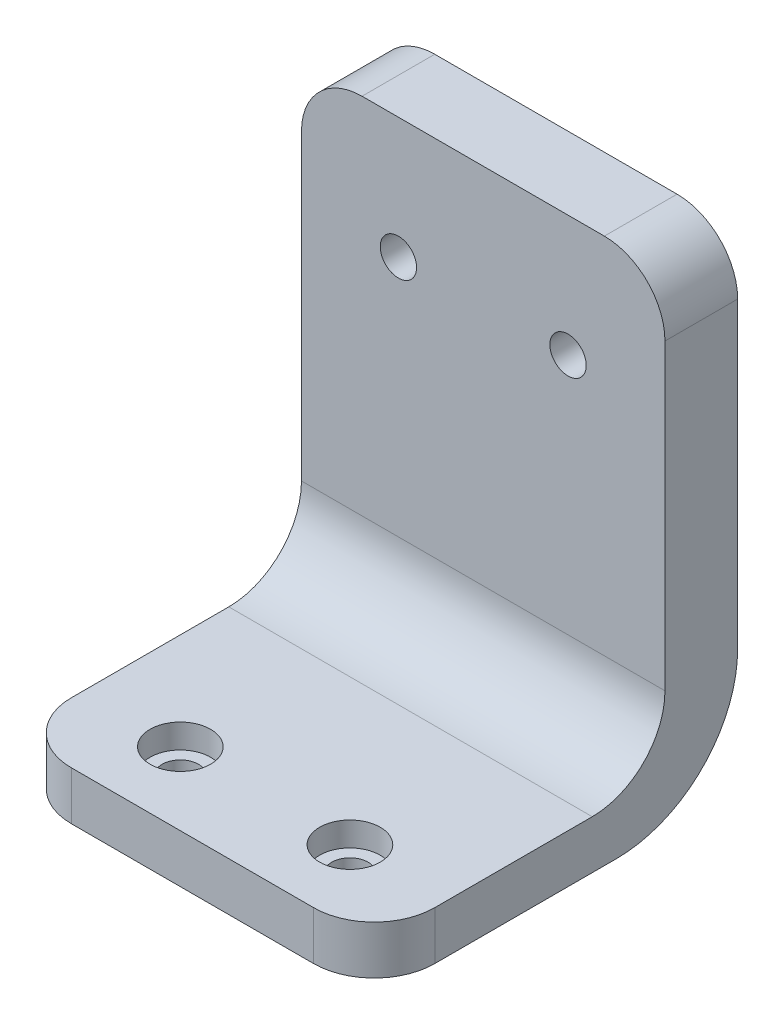
ISO-10303-21;
HEADER;
FILE_DESCRIPTION(('STEP AP214'),'2;1');
FILE_NAME('part.step','',(''),(''),'','','');
FILE_SCHEMA(('AUTOMOTIVE_DESIGN { 1 0 10303 214 1 1 1 1 }'));
ENDSEC;
DATA;
#1=APPLICATION_CONTEXT('core data for automotive mechanical design processes');
#2=APPLICATION_PROTOCOL_DEFINITION('international standard','automotive_design',2000,#1);
#3=PRODUCT_CONTEXT('',#1,'mechanical');
#4=PRODUCT('Part','Part','',(#3));
#5=PRODUCT_RELATED_PRODUCT_CATEGORY('part','',(#4));
#6=PRODUCT_DEFINITION_FORMATION('','',#4);
#7=PRODUCT_DEFINITION_CONTEXT('part definition',#1,'design');
#8=PRODUCT_DEFINITION('design','',#6,#7);
#9=PRODUCT_DEFINITION_SHAPE('','',#8);
#10=(LENGTH_UNIT() NAMED_UNIT(*) SI_UNIT(.MILLI.,.METRE.));
#11=(NAMED_UNIT(*) PLANE_ANGLE_UNIT() SI_UNIT($,.RADIAN.));
#12=(NAMED_UNIT(*) SI_UNIT($,.STERADIAN.) SOLID_ANGLE_UNIT());
#13=UNCERTAINTY_MEASURE_WITH_UNIT(LENGTH_MEASURE(1.E-05),#10,'distance_accuracy_value','');
#14=(GEOMETRIC_REPRESENTATION_CONTEXT(3) GLOBAL_UNCERTAINTY_ASSIGNED_CONTEXT((#13)) GLOBAL_UNIT_ASSIGNED_CONTEXT((#10,
#11,#12)) REPRESENTATION_CONTEXT('',''));
#15=CARTESIAN_POINT('',(0.,0.,0.));
#16=DIRECTION('',(0.,0.,1.));
#17=DIRECTION('',(1.,0.,0.));
#18=AXIS2_PLACEMENT_3D('',#15,#16,#17);
#19=CARTESIAN_POINT('',(22.,-25.001,18.));
#20=DIRECTION('',(0.,1.,0.));
#21=DIRECTION('',(0.,0.,1.));
#22=AXIS2_PLACEMENT_3D('',#19,#20,#21);
#23=CYLINDRICAL_SURFACE('',#22,1.5);
#24=CARTESIAN_POINT('',(22.,-25.,18.));
#25=DIRECTION('',(0.,1.,0.));
#26=DIRECTION('',(0.,0.,1.));
#27=AXIS2_PLACEMENT_3D('',#24,#25,#26);
#28=CIRCLE('',#27,1.5);
#29=CARTESIAN_POINT('',(22.,-25.,19.5));
#30=VERTEX_POINT('',#29);
#31=EDGE_CURVE('E226',#30,#30,#28,.F.);
#32=ORIENTED_EDGE('',*,*,#31,.T.);
#33=EDGE_LOOP('',(#32));
#34=FACE_BOUND('',#33,.T.);
#35=CARTESIAN_POINT('',(22.,-23.,18.));
#36=DIRECTION('',(0.,1.,0.));
#37=DIRECTION('',(0.,0.,1.));
#38=AXIS2_PLACEMENT_3D('',#35,#36,#37);
#39=CIRCLE('',#38,1.5);
#40=CARTESIAN_POINT('',(22.,-23.,19.5));
#41=VERTEX_POINT('',#40);
#42=EDGE_CURVE('E38',#41,#41,#39,.F.);
#43=ORIENTED_EDGE('',*,*,#42,.F.);
#44=EDGE_LOOP('',(#43));
#45=FACE_BOUND('',#44,.T.);
#46=ADVANCED_FACE('F34',(#34,#45),#23,.F.);
#47=CARTESIAN_POINT('',(8.,-25.001,18.));
#48=DIRECTION('',(0.,1.,0.));
#49=DIRECTION('',(0.,0.,1.));
#50=AXIS2_PLACEMENT_3D('',#47,#48,#49);
#51=CYLINDRICAL_SURFACE('',#50,1.5);
#52=CARTESIAN_POINT('',(8.,-25.,18.));
#53=DIRECTION('',(0.,1.,0.));
#54=DIRECTION('',(0.,0.,1.));
#55=AXIS2_PLACEMENT_3D('',#52,#53,#54);
#56=CIRCLE('',#55,1.5);
#57=CARTESIAN_POINT('',(8.,-25.,19.5));
#58=VERTEX_POINT('',#57);
#59=EDGE_CURVE('E165',#58,#58,#56,.F.);
#60=ORIENTED_EDGE('',*,*,#59,.T.);
#61=EDGE_LOOP('',(#60));
#62=FACE_BOUND('',#61,.T.);
#63=CARTESIAN_POINT('',(8.,-23.,18.));
#64=DIRECTION('',(0.,1.,0.));
#65=DIRECTION('',(0.,0.,1.));
#66=AXIS2_PLACEMENT_3D('',#63,#64,#65);
#67=CIRCLE('',#66,1.5);
#68=CARTESIAN_POINT('',(8.,-23.,19.5));
#69=VERTEX_POINT('',#68);
#70=EDGE_CURVE('E220',#69,#69,#67,.F.);
#71=ORIENTED_EDGE('',*,*,#70,.F.);
#72=EDGE_LOOP('',(#71));
#73=FACE_BOUND('',#72,.T.);
#74=ADVANCED_FACE('F301',(#62,#73),#51,.F.);
#75=CARTESIAN_POINT('',(30.,15.,-6.));
#76=DIRECTION('',(0.,-1.,0.));
#77=DIRECTION('',(0.,0.,-1.));
#78=AXIS2_PLACEMENT_3D('',#75,#76,#77);
#79=PLANE('',#78);
#80=DIRECTION('',(-1.,0.,0.));
#81=VECTOR('',#80,1.);
#82=CARTESIAN_POINT('',(30.,15.,0.));
#83=LINE('',#82,#81);
#84=CARTESIAN_POINT('',(25.,15.,0.));
#85=VERTEX_POINT('',#84);
#86=CARTESIAN_POINT('',(5.,15.,0.));
#87=VERTEX_POINT('',#86);
#88=EDGE_CURVE('E145',#85,#87,#83,.T.);
#89=ORIENTED_EDGE('',*,*,#88,.F.);
#90=DIRECTION('',(0.,0.,1.));
#91=VECTOR('',#90,1.);
#92=CARTESIAN_POINT('',(25.,15.,-6.));
#93=LINE('',#92,#91);
#94=CARTESIAN_POINT('',(25.,15.,-6.));
#95=VERTEX_POINT('',#94);
#96=EDGE_CURVE('E202',#85,#95,#93,.F.);
#97=ORIENTED_EDGE('',*,*,#96,.T.);
#98=DIRECTION('',(-1.,0.,0.));
#99=VECTOR('',#98,1.);
#100=CARTESIAN_POINT('',(30.,15.,-6.));
#101=LINE('',#100,#99);
#102=CARTESIAN_POINT('',(5.,15.,-6.));
#103=VERTEX_POINT('',#102);
#104=EDGE_CURVE('E162',#95,#103,#101,.T.);
#105=ORIENTED_EDGE('',*,*,#104,.T.);
#106=DIRECTION('',(0.,0.,1.));
#107=VECTOR('',#106,1.);
#108=CARTESIAN_POINT('',(5.,15.,0.));
#109=LINE('',#108,#107);
#110=EDGE_CURVE('E199',#103,#87,#109,.T.);
#111=ORIENTED_EDGE('',*,*,#110,.T.);
#112=EDGE_LOOP('',(#89,#97,#105,#111));
#113=FACE_BOUND('',#112,.T.);
#114=ADVANCED_FACE('F288',(#113),#79,.F.);
#115=CARTESIAN_POINT('',(30.,15.,0.));
#116=DIRECTION('',(0.,0.,-1.));
#117=DIRECTION('',(0.,1.,0.));
#118=AXIS2_PLACEMENT_3D('',#115,#116,#117);
#119=PLANE('',#118);
#120=CARTESIAN_POINT('',(8.,5.,0.));
#121=DIRECTION('',(0.,0.,1.));
#122=DIRECTION('',(1.,0.,0.));
#123=AXIS2_PLACEMENT_3D('',#120,#121,#122);
#124=CIRCLE('',#123,1.5);
#125=CARTESIAN_POINT('',(9.5,5.,0.));
#126=VERTEX_POINT('',#125);
#127=EDGE_CURVE('E464',#126,#126,#124,.T.);
#128=ORIENTED_EDGE('',*,*,#127,.F.);
#129=EDGE_LOOP('',(#128));
#130=FACE_BOUND('',#129,.T.);
#131=CARTESIAN_POINT('',(22.,5.,0.));
#132=DIRECTION('',(0.,0.,1.));
#133=DIRECTION('',(1.,0.,0.));
#134=AXIS2_PLACEMENT_3D('',#131,#132,#133);
#135=CIRCLE('',#134,1.5);
#136=CARTESIAN_POINT('',(23.5,5.,0.));
#137=VERTEX_POINT('',#136);
#138=EDGE_CURVE('E236',#137,#137,#135,.T.);
#139=ORIENTED_EDGE('',*,*,#138,.F.);
#140=EDGE_LOOP('',(#139));
#141=FACE_BOUND('',#140,.T.);
#142=DIRECTION('',(0.,-1.,0.));
#143=VECTOR('',#142,1.);
#144=CARTESIAN_POINT('',(30.,15.,0.));
#145=LINE('',#144,#143);
#146=CARTESIAN_POINT('',(30.,10.,0.));
#147=VERTEX_POINT('',#146);
#148=CARTESIAN_POINT('',(30.,-15.,0.));
#149=VERTEX_POINT('',#148);
#150=EDGE_CURVE('E125',#147,#149,#145,.T.);
#151=ORIENTED_EDGE('',*,*,#150,.F.);
#152=CARTESIAN_POINT('',(25.,10.,0.));
#153=DIRECTION('',(0.,0.,-1.));
#154=DIRECTION('',(0.,1.,0.));
#155=AXIS2_PLACEMENT_3D('',#152,#153,#154);
#156=CIRCLE('',#155,5.);
#157=EDGE_CURVE('E197',#147,#85,#156,.F.);
#158=ORIENTED_EDGE('',*,*,#157,.T.);
#159=ORIENTED_EDGE('',*,*,#88,.T.);
#160=CARTESIAN_POINT('',(5.,10.,0.));
#161=DIRECTION('',(0.,0.,-1.));
#162=DIRECTION('',(0.,1.,0.));
#163=AXIS2_PLACEMENT_3D('',#160,#161,#162);
#164=CIRCLE('',#163,5.);
#165=CARTESIAN_POINT('',(0.,10.,0.));
#166=VERTEX_POINT('',#165);
#167=EDGE_CURVE('E195',#87,#166,#164,.F.);
#168=ORIENTED_EDGE('',*,*,#167,.T.);
#169=DIRECTION('',(0.,-1.,0.));
#170=VECTOR('',#169,1.);
#171=CARTESIAN_POINT('',(0.,15.,0.));
#172=LINE('',#171,#170);
#173=CARTESIAN_POINT('',(0.,-15.,0.));
#174=VERTEX_POINT('',#173);
#175=EDGE_CURVE('E142',#166,#174,#172,.T.);
#176=ORIENTED_EDGE('',*,*,#175,.T.);
#177=DIRECTION('',(-1.,0.,0.));
#178=VECTOR('',#177,1.);
#179=CARTESIAN_POINT('',(30.,-15.,0.));
#180=LINE('',#179,#178);
#181=EDGE_CURVE('E139',#149,#174,#180,.T.);
#182=ORIENTED_EDGE('',*,*,#181,.F.);
#183=EDGE_LOOP('',(#151,#158,#159,#168,#176,#182));
#184=FACE_BOUND('',#183,.T.);
#185=ADVANCED_FACE('F140',(#130,#141,#184),#119,.F.);
#186=CARTESIAN_POINT('',(30.,-15.,6.));
#187=DIRECTION('',(-1.,0.,0.));
#188=DIRECTION('',(0.,0.,1.));
#189=AXIS2_PLACEMENT_3D('',#186,#187,#188);
#190=CYLINDRICAL_SURFACE('',#189,6.);
#191=CARTESIAN_POINT('',(0.,-15.,6.));
#192=DIRECTION('',(-1.,0.,0.));
#193=DIRECTION('',(0.,0.,1.));
#194=AXIS2_PLACEMENT_3D('',#191,#192,#193);
#195=CIRCLE('',#194,6.);
#196=CARTESIAN_POINT('',(0.,-21.,6.));
#197=VERTEX_POINT('',#196);
#198=EDGE_CURVE('E164',#174,#197,#195,.T.);
#199=ORIENTED_EDGE('',*,*,#198,.T.);
#200=DIRECTION('',(-1.,0.,0.));
#201=VECTOR('',#200,1.);
#202=CARTESIAN_POINT('',(30.,-21.,6.));
#203=LINE('',#202,#201);
#204=CARTESIAN_POINT('',(30.,-21.,6.));
#205=VERTEX_POINT('',#204);
#206=EDGE_CURVE('E146',#205,#197,#203,.T.);
#207=ORIENTED_EDGE('',*,*,#206,.F.);
#208=CARTESIAN_POINT('',(30.,-15.,6.));
#209=DIRECTION('',(-1.,0.,0.));
#210=DIRECTION('',(0.,0.,1.));
#211=AXIS2_PLACEMENT_3D('',#208,#209,#210);
#212=CIRCLE('',#211,6.);
#213=EDGE_CURVE('E131',#149,#205,#212,.T.);
#214=ORIENTED_EDGE('',*,*,#213,.F.);
#215=ORIENTED_EDGE('',*,*,#181,.T.);
#216=EDGE_LOOP('',(#199,#207,#214,#215));
#217=FACE_BOUND('',#216,.T.);
#218=ADVANCED_FACE('F148',(#217),#190,.F.);
#219=CARTESIAN_POINT('',(30.,-21.,6.));
#220=DIRECTION('',(0.,-1.,0.));
#221=DIRECTION('',(0.,0.,-1.));
#222=AXIS2_PLACEMENT_3D('',#219,#220,#221);
#223=PLANE('',#222);
#224=CARTESIAN_POINT('',(8.,-21.,18.));
#225=DIRECTION('',(0.,1.,0.));
#226=DIRECTION('',(0.,0.,1.));
#227=AXIS2_PLACEMENT_3D('',#224,#225,#226);
#228=CIRCLE('',#227,2.5);
#229=CARTESIAN_POINT('',(8.,-21.,20.5));
#230=VERTEX_POINT('',#229);
#231=EDGE_CURVE('E228',#230,#230,#228,.T.);
#232=ORIENTED_EDGE('',*,*,#231,.F.);
#233=EDGE_LOOP('',(#232));
#234=FACE_BOUND('',#233,.T.);
#235=CARTESIAN_POINT('',(22.,-21.,18.));
#236=DIRECTION('',(0.,1.,0.));
#237=DIRECTION('',(0.,0.,1.));
#238=AXIS2_PLACEMENT_3D('',#235,#236,#237);
#239=CIRCLE('',#238,2.5);
#240=CARTESIAN_POINT('',(22.,-21.,20.5));
#241=VERTEX_POINT('',#240);
#242=EDGE_CURVE('E233',#241,#241,#239,.T.);
#243=ORIENTED_EDGE('',*,*,#242,.F.);
#244=EDGE_LOOP('',(#243));
#245=FACE_BOUND('',#244,.T.);
#246=DIRECTION('',(-1.,0.,0.));
#247=VECTOR('',#246,1.);
#248=CARTESIAN_POINT('',(30.,-21.,24.));
#249=LINE('',#248,#247);
#250=CARTESIAN_POINT('',(25.,-21.,24.));
#251=VERTEX_POINT('',#250);
#252=CARTESIAN_POINT('',(5.,-21.,24.));
#253=VERTEX_POINT('',#252);
#254=EDGE_CURVE('E186',#251,#253,#249,.T.);
#255=ORIENTED_EDGE('',*,*,#254,.F.);
#256=CARTESIAN_POINT('',(25.,-21.,19.));
#257=DIRECTION('',(0.,-1.,0.));
#258=DIRECTION('',(0.,0.,-1.));
#259=AXIS2_PLACEMENT_3D('',#256,#257,#258);
#260=CIRCLE('',#259,5.);
#261=CARTESIAN_POINT('',(30.,-21.,19.));
#262=VERTEX_POINT('',#261);
#263=EDGE_CURVE('E11',#251,#262,#260,.F.);
#264=ORIENTED_EDGE('',*,*,#263,.T.);
#265=DIRECTION('',(0.,0.,1.));
#266=VECTOR('',#265,1.);
#267=CARTESIAN_POINT('',(30.,-21.,6.));
#268=LINE('',#267,#266);
#269=EDGE_CURVE('E151',#205,#262,#268,.T.);
#270=ORIENTED_EDGE('',*,*,#269,.F.);
#271=ORIENTED_EDGE('',*,*,#206,.T.);
#272=DIRECTION('',(0.,0.,1.));
#273=VECTOR('',#272,1.);
#274=CARTESIAN_POINT('',(0.,-21.,6.));
#275=LINE('',#274,#273);
#276=CARTESIAN_POINT('',(0.,-21.,19.));
#277=VERTEX_POINT('',#276);
#278=EDGE_CURVE('E167',#197,#277,#275,.T.);
#279=ORIENTED_EDGE('',*,*,#278,.T.);
#280=CARTESIAN_POINT('',(5.,-21.,19.));
#281=DIRECTION('',(0.,-1.,0.));
#282=DIRECTION('',(0.,0.,-1.));
#283=AXIS2_PLACEMENT_3D('',#280,#281,#282);
#284=CIRCLE('',#283,5.);
#285=EDGE_CURVE('E43',#277,#253,#284,.F.);
#286=ORIENTED_EDGE('',*,*,#285,.T.);
#287=EDGE_LOOP('',(#255,#264,#270,#271,#279,#286));
#288=FACE_BOUND('',#287,.T.);
#289=ADVANCED_FACE('F266',(#234,#245,#288),#223,.F.);
#290=CARTESIAN_POINT('',(30.,-21.,24.));
#291=DIRECTION('',(0.,0.,-1.));
#292=DIRECTION('',(-1.,0.,0.));
#293=AXIS2_PLACEMENT_3D('',#290,#291,#292);
#294=PLANE('',#293);
#295=DIRECTION('',(-1.,0.,0.));
#296=VECTOR('',#295,1.);
#297=CARTESIAN_POINT('',(30.,-25.,24.));
#298=LINE('',#297,#296);
#299=CARTESIAN_POINT('',(25.,-25.,24.));
#300=VERTEX_POINT('',#299);
#301=CARTESIAN_POINT('',(5.,-25.,24.));
#302=VERTEX_POINT('',#301);
#303=EDGE_CURVE('E183',#300,#302,#298,.T.);
#304=ORIENTED_EDGE('',*,*,#303,.F.);
#305=DIRECTION('',(0.,-1.,0.));
#306=VECTOR('',#305,1.);
#307=CARTESIAN_POINT('',(25.,-21.,24.));
#308=LINE('',#307,#306);
#309=EDGE_CURVE('E57',#300,#251,#308,.F.);
#310=ORIENTED_EDGE('',*,*,#309,.T.);
#311=ORIENTED_EDGE('',*,*,#254,.T.);
#312=DIRECTION('',(0.,-1.,0.));
#313=VECTOR('',#312,1.);
#314=CARTESIAN_POINT('',(5.,-25.,24.));
#315=LINE('',#314,#313);
#316=EDGE_CURVE('E216',#253,#302,#315,.T.);
#317=ORIENTED_EDGE('',*,*,#316,.T.);
#318=EDGE_LOOP('',(#304,#310,#311,#317));
#319=FACE_BOUND('',#318,.T.);
#320=ADVANCED_FACE('F255',(#319),#294,.F.);
#321=CARTESIAN_POINT('',(30.,-25.,24.));
#322=DIRECTION('',(0.,1.,0.));
#323=DIRECTION('',(0.,0.,1.));
#324=AXIS2_PLACEMENT_3D('',#321,#322,#323);
#325=PLANE('',#324);
#326=ORIENTED_EDGE('',*,*,#59,.F.);
#327=EDGE_LOOP('',(#326));
#328=FACE_BOUND('',#327,.T.);
#329=ORIENTED_EDGE('',*,*,#31,.F.);
#330=EDGE_LOOP('',(#329));
#331=FACE_BOUND('',#330,.T.);
#332=DIRECTION('',(0.,0.,-1.));
#333=VECTOR('',#332,1.);
#334=CARTESIAN_POINT('',(30.,-25.,24.));
#335=LINE('',#334,#333);
#336=CARTESIAN_POINT('',(30.,-25.,19.));
#337=VERTEX_POINT('',#336);
#338=CARTESIAN_POINT('',(30.,-25.,4.00000000000001));
#339=VERTEX_POINT('',#338);
#340=EDGE_CURVE('E153',#337,#339,#335,.T.);
#341=ORIENTED_EDGE('',*,*,#340,.F.);
#342=CARTESIAN_POINT('',(25.,-25.,19.));
#343=DIRECTION('',(0.,1.,0.));
#344=DIRECTION('',(0.,0.,1.));
#345=AXIS2_PLACEMENT_3D('',#342,#343,#344);
#346=CIRCLE('',#345,5.);
#347=EDGE_CURVE('E214',#337,#300,#346,.F.);
#348=ORIENTED_EDGE('',*,*,#347,.T.);
#349=ORIENTED_EDGE('',*,*,#303,.T.);
#350=CARTESIAN_POINT('',(5.,-25.,19.));
#351=DIRECTION('',(0.,1.,0.));
#352=DIRECTION('',(0.,0.,1.));
#353=AXIS2_PLACEMENT_3D('',#350,#351,#352);
#354=CIRCLE('',#353,5.);
#355=CARTESIAN_POINT('',(0.,-25.,19.));
#356=VERTEX_POINT('',#355);
#357=EDGE_CURVE('E212',#302,#356,#354,.F.);
#358=ORIENTED_EDGE('',*,*,#357,.T.);
#359=DIRECTION('',(0.,0.,-1.));
#360=VECTOR('',#359,1.);
#361=CARTESIAN_POINT('',(0.,-25.,24.));
#362=LINE('',#361,#360);
#363=CARTESIAN_POINT('',(0.,-25.,4.00000000000001));
#364=VERTEX_POINT('',#363);
#365=EDGE_CURVE('E169',#356,#364,#362,.T.);
#366=ORIENTED_EDGE('',*,*,#365,.T.);
#367=DIRECTION('',(-1.,0.,0.));
#368=VECTOR('',#367,1.);
#369=CARTESIAN_POINT('',(30.,-25.,4.00000000000001));
#370=LINE('',#369,#368);
#371=EDGE_CURVE('E180',#339,#364,#370,.T.);
#372=ORIENTED_EDGE('',*,*,#371,.F.);
#373=EDGE_LOOP('',(#341,#348,#349,#358,#366,#372));
#374=FACE_BOUND('',#373,.T.);
#375=ADVANCED_FACE('F251',(#328,#331,#374),#325,.F.);
#376=CARTESIAN_POINT('',(30.,-15.,4.00000000000001));
#377=DIRECTION('',(-1.,0.,0.));
#378=DIRECTION('',(0.,0.,1.));
#379=AXIS2_PLACEMENT_3D('',#376,#377,#378);
#380=CYLINDRICAL_SURFACE('',#379,10.);
#381=CARTESIAN_POINT('',(0.,-15.,4.00000000000001));
#382=DIRECTION('',(1.,0.,0.));
#383=DIRECTION('',(0.,0.,1.));
#384=AXIS2_PLACEMENT_3D('',#381,#382,#383);
#385=CIRCLE('',#384,10.);
#386=CARTESIAN_POINT('',(0.,-15.,-5.99999999999999));
#387=VERTEX_POINT('',#386);
#388=EDGE_CURVE('E171',#364,#387,#385,.T.);
#389=ORIENTED_EDGE('',*,*,#388,.T.);
#390=DIRECTION('',(-1.,0.,0.));
#391=VECTOR('',#390,1.);
#392=CARTESIAN_POINT('',(30.,-15.,-5.99999999999999));
#393=LINE('',#392,#391);
#394=CARTESIAN_POINT('',(30.,-15.,-5.99999999999999));
#395=VERTEX_POINT('',#394);
#396=EDGE_CURVE('E177',#395,#387,#393,.T.);
#397=ORIENTED_EDGE('',*,*,#396,.F.);
#398=CARTESIAN_POINT('',(30.,-15.,4.00000000000001));
#399=DIRECTION('',(1.,0.,0.));
#400=DIRECTION('',(0.,0.,1.));
#401=AXIS2_PLACEMENT_3D('',#398,#399,#400);
#402=CIRCLE('',#401,10.);
#403=EDGE_CURVE('E158',#339,#395,#402,.T.);
#404=ORIENTED_EDGE('',*,*,#403,.F.);
#405=ORIENTED_EDGE('',*,*,#371,.T.);
#406=EDGE_LOOP('',(#389,#397,#404,#405));
#407=FACE_BOUND('',#406,.T.);
#408=ADVANCED_FACE('F254',(#407),#380,.T.);
#409=CARTESIAN_POINT('',(30.,-15.,-5.99999999999999));
#410=DIRECTION('',(0.,0.,1.));
#411=DIRECTION('',(0.,-1.,0.));
#412=AXIS2_PLACEMENT_3D('',#409,#410,#411);
#413=PLANE('',#412);
#414=CARTESIAN_POINT('',(8.,5.,-6.));
#415=DIRECTION('',(0.,0.,1.));
#416=DIRECTION('',(0.,-1.,0.));
#417=AXIS2_PLACEMENT_3D('',#414,#415,#416);
#418=CIRCLE('',#417,1.5);
#419=CARTESIAN_POINT('',(8.,3.5,-6.));
#420=VERTEX_POINT('',#419);
#421=EDGE_CURVE('E244',#420,#420,#418,.F.);
#422=ORIENTED_EDGE('',*,*,#421,.F.);
#423=EDGE_LOOP('',(#422));
#424=FACE_BOUND('',#423,.T.);
#425=CARTESIAN_POINT('',(22.,5.,-6.));
#426=DIRECTION('',(0.,0.,1.));
#427=DIRECTION('',(0.,-1.,0.));
#428=AXIS2_PLACEMENT_3D('',#425,#426,#427);
#429=CIRCLE('',#428,1.5);
#430=CARTESIAN_POINT('',(22.,3.5,-6.));
#431=VERTEX_POINT('',#430);
#432=EDGE_CURVE('E469',#431,#431,#429,.F.);
#433=ORIENTED_EDGE('',*,*,#432,.F.);
#434=EDGE_LOOP('',(#433));
#435=FACE_BOUND('',#434,.T.);
#436=ORIENTED_EDGE('',*,*,#104,.F.);
#437=CARTESIAN_POINT('',(25.,10.,-6.));
#438=DIRECTION('',(0.,0.,1.));
#439=DIRECTION('',(0.,-1.,0.));
#440=AXIS2_PLACEMENT_3D('',#437,#438,#439);
#441=CIRCLE('',#440,5.);
#442=CARTESIAN_POINT('',(30.,10.,-6.));
#443=VERTEX_POINT('',#442);
#444=EDGE_CURVE('E206',#95,#443,#441,.F.);
#445=ORIENTED_EDGE('',*,*,#444,.T.);
#446=DIRECTION('',(0.,1.,0.));
#447=VECTOR('',#446,1.);
#448=CARTESIAN_POINT('',(30.,-15.,-5.99999999999999));
#449=LINE('',#448,#447);
#450=EDGE_CURVE('E160',#395,#443,#449,.T.);
#451=ORIENTED_EDGE('',*,*,#450,.F.);
#452=ORIENTED_EDGE('',*,*,#396,.T.);
#453=DIRECTION('',(0.,1.,0.));
#454=VECTOR('',#453,1.);
#455=CARTESIAN_POINT('',(0.,-15.,-5.99999999999999));
#456=LINE('',#455,#454);
#457=CARTESIAN_POINT('',(0.,10.,-6.));
#458=VERTEX_POINT('',#457);
#459=EDGE_CURVE('E136',#387,#458,#456,.T.);
#460=ORIENTED_EDGE('',*,*,#459,.T.);
#461=CARTESIAN_POINT('',(5.,10.,-6.));
#462=DIRECTION('',(0.,0.,1.));
#463=DIRECTION('',(0.,-1.,0.));
#464=AXIS2_PLACEMENT_3D('',#461,#462,#463);
#465=CIRCLE('',#464,5.);
#466=EDGE_CURVE('E204',#458,#103,#465,.F.);
#467=ORIENTED_EDGE('',*,*,#466,.T.);
#468=EDGE_LOOP('',(#436,#445,#451,#452,#460,#467));
#469=FACE_BOUND('',#468,.T.);
#470=ADVANCED_FACE('F280',(#424,#435,#469),#413,.F.);
#471=CARTESIAN_POINT('',(30.,-15.,6.));
#472=DIRECTION('',(-1.,0.,0.));
#473=DIRECTION('',(0.,0.,1.));
#474=AXIS2_PLACEMENT_3D('',#471,#472,#473);
#475=PLANE('',#474);
#476=ORIENTED_EDGE('',*,*,#450,.T.);
#477=DIRECTION('',(0.,0.,1.));
#478=VECTOR('',#477,1.);
#479=CARTESIAN_POINT('',(30.,10.,6.));
#480=LINE('',#479,#478);
#481=EDGE_CURVE('E134',#443,#147,#480,.T.);
#482=ORIENTED_EDGE('',*,*,#481,.T.);
#483=ORIENTED_EDGE('',*,*,#150,.T.);
#484=ORIENTED_EDGE('',*,*,#213,.T.);
#485=ORIENTED_EDGE('',*,*,#269,.T.);
#486=DIRECTION('',(0.,-1.,0.));
#487=VECTOR('',#486,1.);
#488=CARTESIAN_POINT('',(30.,-15.,19.));
#489=LINE('',#488,#487);
#490=EDGE_CURVE('E191',#262,#337,#489,.T.);
#491=ORIENTED_EDGE('',*,*,#490,.T.);
#492=ORIENTED_EDGE('',*,*,#340,.T.);
#493=ORIENTED_EDGE('',*,*,#403,.T.);
#494=EDGE_LOOP('',(#476,#482,#483,#484,#485,#491,#492,#493));
#495=FACE_BOUND('',#494,.T.);
#496=ADVANCED_FACE('F128',(#495),#475,.F.);
#497=CARTESIAN_POINT('',(0.,-15.,6.));
#498=DIRECTION('',(-1.,0.,0.));
#499=DIRECTION('',(0.,0.,1.));
#500=AXIS2_PLACEMENT_3D('',#497,#498,#499);
#501=PLANE('',#500);
#502=ORIENTED_EDGE('',*,*,#175,.F.);
#503=DIRECTION('',(0.,0.,1.));
#504=VECTOR('',#503,1.);
#505=CARTESIAN_POINT('',(0.,10.,-6.));
#506=LINE('',#505,#504);
#507=EDGE_CURVE('E210',#166,#458,#506,.F.);
#508=ORIENTED_EDGE('',*,*,#507,.T.);
#509=ORIENTED_EDGE('',*,*,#459,.F.);
#510=ORIENTED_EDGE('',*,*,#388,.F.);
#511=ORIENTED_EDGE('',*,*,#365,.F.);
#512=DIRECTION('',(0.,-1.,0.));
#513=VECTOR('',#512,1.);
#514=CARTESIAN_POINT('',(0.,-21.,19.));
#515=LINE('',#514,#513);
#516=EDGE_CURVE('E208',#356,#277,#515,.F.);
#517=ORIENTED_EDGE('',*,*,#516,.T.);
#518=ORIENTED_EDGE('',*,*,#278,.F.);
#519=ORIENTED_EDGE('',*,*,#198,.F.);
#520=EDGE_LOOP('',(#502,#508,#509,#510,#511,#517,#518,#519));
#521=FACE_BOUND('',#520,.T.);
#522=ADVANCED_FACE('F273',(#521),#501,.T.);
#523=CARTESIAN_POINT('',(25.,10.,6.));
#524=DIRECTION('',(0.,0.,1.));
#525=DIRECTION('',(1.,0.,0.));
#526=AXIS2_PLACEMENT_3D('',#523,#524,#525);
#527=CYLINDRICAL_SURFACE('',#526,5.);
#528=ORIENTED_EDGE('',*,*,#444,.F.);
#529=ORIENTED_EDGE('',*,*,#96,.F.);
#530=ORIENTED_EDGE('',*,*,#157,.F.);
#531=ORIENTED_EDGE('',*,*,#481,.F.);
#532=EDGE_LOOP('',(#528,#529,#530,#531));
#533=FACE_BOUND('',#532,.T.);
#534=ADVANCED_FACE('F284',(#533),#527,.T.);
#535=CARTESIAN_POINT('',(5.,10.,-6.));
#536=DIRECTION('',(0.,0.,-1.));
#537=DIRECTION('',(-1.,0.,0.));
#538=AXIS2_PLACEMENT_3D('',#535,#536,#537);
#539=CYLINDRICAL_SURFACE('',#538,5.);
#540=ORIENTED_EDGE('',*,*,#466,.F.);
#541=ORIENTED_EDGE('',*,*,#507,.F.);
#542=ORIENTED_EDGE('',*,*,#167,.F.);
#543=ORIENTED_EDGE('',*,*,#110,.F.);
#544=EDGE_LOOP('',(#540,#541,#542,#543));
#545=FACE_BOUND('',#544,.T.);
#546=ADVANCED_FACE('F291',(#545),#539,.T.);
#547=CARTESIAN_POINT('',(25.,-15.,19.));
#548=DIRECTION('',(0.,-1.,0.));
#549=DIRECTION('',(0.,0.,-1.));
#550=AXIS2_PLACEMENT_3D('',#547,#548,#549);
#551=CYLINDRICAL_SURFACE('',#550,5.);
#552=ORIENTED_EDGE('',*,*,#263,.F.);
#553=ORIENTED_EDGE('',*,*,#309,.F.);
#554=ORIENTED_EDGE('',*,*,#347,.F.);
#555=ORIENTED_EDGE('',*,*,#490,.F.);
#556=EDGE_LOOP('',(#552,#553,#554,#555));
#557=FACE_BOUND('',#556,.T.);
#558=ADVANCED_FACE('F265',(#557),#551,.T.);
#559=CARTESIAN_POINT('',(5.,-21.,19.));
#560=DIRECTION('',(0.,1.,0.));
#561=DIRECTION('',(0.,0.,1.));
#562=AXIS2_PLACEMENT_3D('',#559,#560,#561);
#563=CYLINDRICAL_SURFACE('',#562,5.);
#564=ORIENTED_EDGE('',*,*,#285,.F.);
#565=ORIENTED_EDGE('',*,*,#516,.F.);
#566=ORIENTED_EDGE('',*,*,#357,.F.);
#567=ORIENTED_EDGE('',*,*,#316,.F.);
#568=EDGE_LOOP('',(#564,#565,#566,#567));
#569=FACE_BOUND('',#568,.T.);
#570=ADVANCED_FACE('F36',(#569),#563,.T.);
#571=CARTESIAN_POINT('',(8.,-23.,18.));
#572=DIRECTION('',(0.,1.,0.));
#573=DIRECTION('',(0.,0.,1.));
#574=AXIS2_PLACEMENT_3D('',#571,#572,#573);
#575=PLANE('',#574);
#576=CARTESIAN_POINT('',(8.,-23.,18.));
#577=DIRECTION('',(0.,1.,0.));
#578=DIRECTION('',(0.,0.,1.));
#579=AXIS2_PLACEMENT_3D('',#576,#577,#578);
#580=CIRCLE('',#579,2.5);
#581=CARTESIAN_POINT('',(8.,-23.,20.5));
#582=VERTEX_POINT('',#581);
#583=EDGE_CURVE('E222',#582,#582,#580,.T.);
#584=ORIENTED_EDGE('',*,*,#583,.T.);
#585=EDGE_LOOP('',(#584));
#586=FACE_BOUND('',#585,.T.);
#587=ORIENTED_EDGE('',*,*,#70,.T.);
#588=EDGE_LOOP('',(#587));
#589=FACE_BOUND('',#588,.T.);
#590=ADVANCED_FACE('F395',(#586,#589),#575,.T.);
#591=CARTESIAN_POINT('',(8.,-23.,18.));
#592=DIRECTION('',(0.,1.,0.));
#593=DIRECTION('',(0.,0.,1.));
#594=AXIS2_PLACEMENT_3D('',#591,#592,#593);
#595=CYLINDRICAL_SURFACE('',#594,2.5);
#596=ORIENTED_EDGE('',*,*,#583,.F.);
#597=EDGE_LOOP('',(#596));
#598=FACE_BOUND('',#597,.T.);
#599=ORIENTED_EDGE('',*,*,#231,.T.);
#600=EDGE_LOOP('',(#599));
#601=FACE_BOUND('',#600,.T.);
#602=ADVANCED_FACE('F403',(#598,#601),#595,.F.);
#603=CARTESIAN_POINT('',(22.,-23.,18.));
#604=DIRECTION('',(0.,1.,0.));
#605=DIRECTION('',(0.,0.,1.));
#606=AXIS2_PLACEMENT_3D('',#603,#604,#605);
#607=PLANE('',#606);
#608=CARTESIAN_POINT('',(22.,-23.,18.));
#609=DIRECTION('',(0.,1.,0.));
#610=DIRECTION('',(0.,0.,1.));
#611=AXIS2_PLACEMENT_3D('',#608,#609,#610);
#612=CIRCLE('',#611,2.5);
#613=CARTESIAN_POINT('',(22.,-23.,20.5));
#614=VERTEX_POINT('',#613);
#615=EDGE_CURVE('E241',#614,#614,#612,.T.);
#616=ORIENTED_EDGE('',*,*,#615,.T.);
#617=EDGE_LOOP('',(#616));
#618=FACE_BOUND('',#617,.T.);
#619=ORIENTED_EDGE('',*,*,#42,.T.);
#620=EDGE_LOOP('',(#619));
#621=FACE_BOUND('',#620,.T.);
#622=ADVANCED_FACE('F410',(#618,#621),#607,.T.);
#623=CARTESIAN_POINT('',(22.,-23.,18.));
#624=DIRECTION('',(0.,1.,0.));
#625=DIRECTION('',(0.,0.,1.));
#626=AXIS2_PLACEMENT_3D('',#623,#624,#625);
#627=CYLINDRICAL_SURFACE('',#626,2.5);
#628=ORIENTED_EDGE('',*,*,#615,.F.);
#629=EDGE_LOOP('',(#628));
#630=FACE_BOUND('',#629,.T.);
#631=ORIENTED_EDGE('',*,*,#242,.T.);
#632=EDGE_LOOP('',(#631));
#633=FACE_BOUND('',#632,.T.);
#634=ADVANCED_FACE('F418',(#630,#633),#627,.F.);
#635=CARTESIAN_POINT('',(22.,5.,-6.001));
#636=DIRECTION('',(0.,0.,1.));
#637=DIRECTION('',(1.,0.,0.));
#638=AXIS2_PLACEMENT_3D('',#635,#636,#637);
#639=CYLINDRICAL_SURFACE('',#638,1.5);
#640=ORIENTED_EDGE('',*,*,#138,.T.);
#641=EDGE_LOOP('',(#640));
#642=FACE_BOUND('',#641,.T.);
#643=ORIENTED_EDGE('',*,*,#432,.T.);
#644=EDGE_LOOP('',(#643));
#645=FACE_BOUND('',#644,.T.);
#646=ADVANCED_FACE('F424',(#642,#645),#639,.F.);
#647=CARTESIAN_POINT('',(8.,5.,-6.001));
#648=DIRECTION('',(0.,0.,1.));
#649=DIRECTION('',(1.,0.,0.));
#650=AXIS2_PLACEMENT_3D('',#647,#648,#649);
#651=CYLINDRICAL_SURFACE('',#650,1.5);
#652=ORIENTED_EDGE('',*,*,#127,.T.);
#653=EDGE_LOOP('',(#652));
#654=FACE_BOUND('',#653,.T.);
#655=ORIENTED_EDGE('',*,*,#421,.T.);
#656=EDGE_LOOP('',(#655));
#657=FACE_BOUND('',#656,.T.);
#658=ADVANCED_FACE('F431',(#654,#657),#651,.F.);
#659=CLOSED_SHELL('',(#46,#74,#114,#185,#218,#289,#320,#375,#408,#470,#496,#522,#534,#546,#558,
#570,#590,#602,#622,#634,#646,#658));
#660=MANIFOLD_SOLID_BREP('B2',#659);
#661=ADVANCED_BREP_SHAPE_REPRESENTATION('',(#18,#660),#14);
#662=SHAPE_DEFINITION_REPRESENTATION(#9,#661);
ENDSEC;
END-ISO-10303-21;
